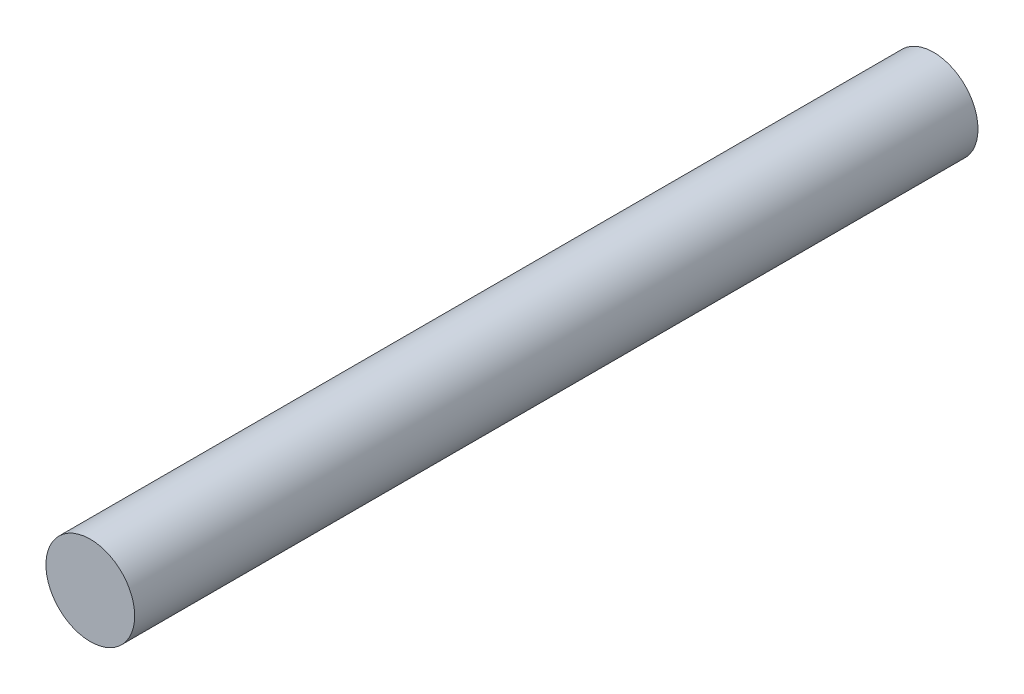
ISO-10303-21;
HEADER;
FILE_DESCRIPTION(('STEP AP214'),'2;1');
FILE_NAME('part.step','',(''),(''),'','','');
FILE_SCHEMA(('AUTOMOTIVE_DESIGN { 1 0 10303 214 1 1 1 1 }'));
ENDSEC;
DATA;
#1=APPLICATION_CONTEXT('core data for automotive mechanical design processes');
#2=APPLICATION_PROTOCOL_DEFINITION('international standard','automotive_design',2000,#1);
#3=PRODUCT_CONTEXT('',#1,'mechanical');
#4=PRODUCT('Part','Part','',(#3));
#5=PRODUCT_RELATED_PRODUCT_CATEGORY('part','',(#4));
#6=PRODUCT_DEFINITION_FORMATION('','',#4);
#7=PRODUCT_DEFINITION_CONTEXT('part definition',#1,'design');
#8=PRODUCT_DEFINITION('design','',#6,#7);
#9=PRODUCT_DEFINITION_SHAPE('','',#8);
#10=(LENGTH_UNIT() NAMED_UNIT(*) SI_UNIT(.MILLI.,.METRE.));
#11=(NAMED_UNIT(*) PLANE_ANGLE_UNIT() SI_UNIT($,.RADIAN.));
#12=(NAMED_UNIT(*) SI_UNIT($,.STERADIAN.) SOLID_ANGLE_UNIT());
#13=UNCERTAINTY_MEASURE_WITH_UNIT(LENGTH_MEASURE(1.E-05),#10,'distance_accuracy_value','');
#14=(GEOMETRIC_REPRESENTATION_CONTEXT(3) GLOBAL_UNCERTAINTY_ASSIGNED_CONTEXT((#13)) GLOBAL_UNIT_ASSIGNED_CONTEXT((#10,
#11,#12)) REPRESENTATION_CONTEXT('',''));
#15=CARTESIAN_POINT('',(0.,0.,0.));
#16=DIRECTION('',(0.,0.,1.));
#17=DIRECTION('',(1.,0.,0.));
#18=AXIS2_PLACEMENT_3D('',#15,#16,#17);
#19=CARTESIAN_POINT('',(0.,0.,38.));
#20=DIRECTION('',(0.,0.,-1.));
#21=DIRECTION('',(-1.,0.,0.));
#22=AXIS2_PLACEMENT_3D('',#19,#20,#21);
#23=CYLINDRICAL_SURFACE('',#22,2.);
#24=CARTESIAN_POINT('',(0.,0.,38.));
#25=DIRECTION('',(0.,0.,1.));
#26=DIRECTION('',(1.,0.,0.));
#27=AXIS2_PLACEMENT_3D('',#24,#25,#26);
#28=CIRCLE('',#27,2.);
#29=CARTESIAN_POINT('',(2.,0.,38.));
#30=VERTEX_POINT('',#29);
#31=EDGE_CURVE('E10',#30,#30,#28,.T.);
#32=ORIENTED_EDGE('',*,*,#31,.F.);
#33=EDGE_LOOP('',(#32));
#34=FACE_BOUND('',#33,.T.);
#35=CARTESIAN_POINT('',(0.,0.,0.));
#36=DIRECTION('',(0.,0.,1.));
#37=DIRECTION('',(1.,0.,0.));
#38=AXIS2_PLACEMENT_3D('',#35,#36,#37);
#39=CIRCLE('',#38,2.);
#40=CARTESIAN_POINT('',(2.,0.,0.));
#41=VERTEX_POINT('',#40);
#42=EDGE_CURVE('E18',#41,#41,#39,.T.);
#43=ORIENTED_EDGE('',*,*,#42,.T.);
#44=EDGE_LOOP('',(#43));
#45=FACE_BOUND('',#44,.T.);
#46=ADVANCED_FACE('F15',(#34,#45),#23,.T.);
#47=CARTESIAN_POINT('',(0.,0.,38.));
#48=DIRECTION('',(0.,0.,1.));
#49=DIRECTION('',(1.,0.,0.));
#50=AXIS2_PLACEMENT_3D('',#47,#48,#49);
#51=PLANE('',#50);
#52=ORIENTED_EDGE('',*,*,#31,.T.);
#53=EDGE_LOOP('',(#52));
#54=FACE_BOUND('',#53,.T.);
#55=ADVANCED_FACE('F30',(#54),#51,.T.);
#56=CARTESIAN_POINT('',(0.,0.,0.));
#57=DIRECTION('',(0.,0.,1.));
#58=DIRECTION('',(1.,0.,0.));
#59=AXIS2_PLACEMENT_3D('',#56,#57,#58);
#60=PLANE('',#59);
#61=ORIENTED_EDGE('',*,*,#42,.F.);
#62=EDGE_LOOP('',(#61));
#63=FACE_BOUND('',#62,.T.);
#64=ADVANCED_FACE('F28',(#63),#60,.F.);
#65=CLOSED_SHELL('',(#46,#55,#64));
#66=MANIFOLD_SOLID_BREP('B1',#65);
#67=ADVANCED_BREP_SHAPE_REPRESENTATION('',(#18,#66),#14);
#68=SHAPE_DEFINITION_REPRESENTATION(#9,#67);
ENDSEC;
END-ISO-10303-21;
